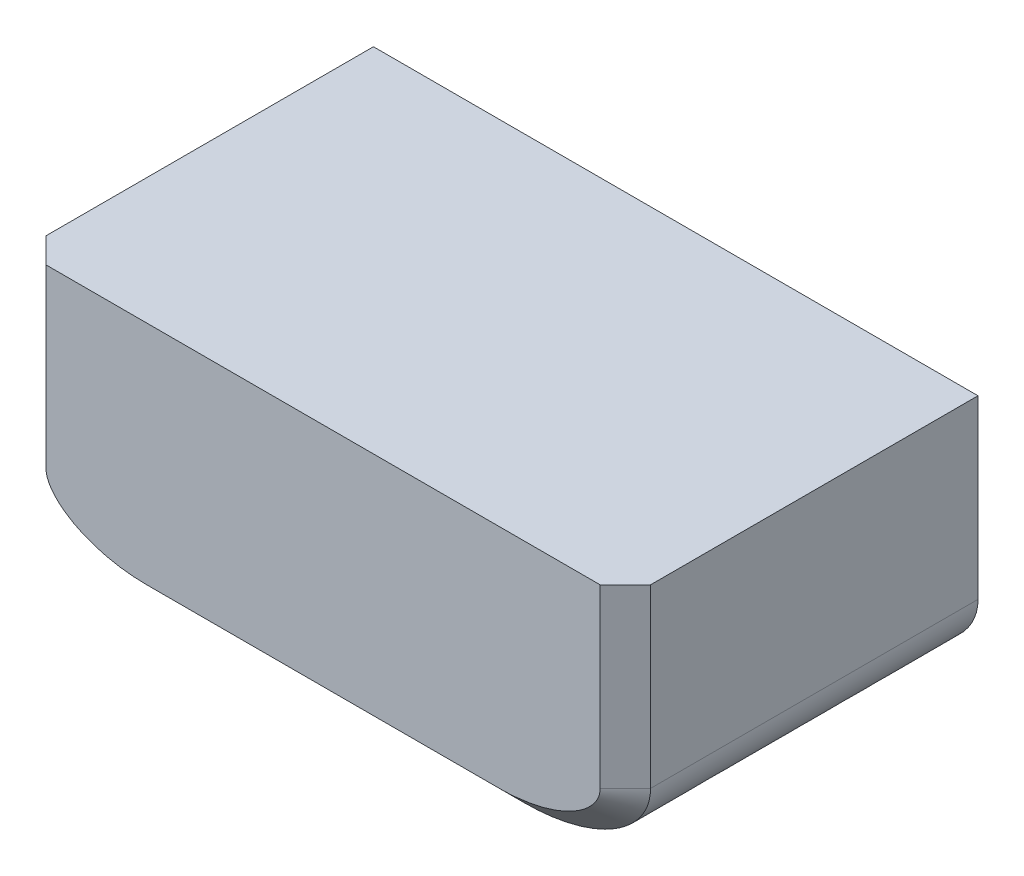
ISO-10303-21;
HEADER;
FILE_DESCRIPTION(('STEP AP214'),'2;1');
FILE_NAME('part.step','',(''),(''),'','','');
FILE_SCHEMA(('AUTOMOTIVE_DESIGN { 1 0 10303 214 1 1 1 1 }'));
ENDSEC;
DATA;
#1=APPLICATION_CONTEXT('core data for automotive mechanical design processes');
#2=APPLICATION_PROTOCOL_DEFINITION('international standard','automotive_design',2000,#1);
#3=PRODUCT_CONTEXT('',#1,'mechanical');
#4=PRODUCT('Part','Part','',(#3));
#5=PRODUCT_RELATED_PRODUCT_CATEGORY('part','',(#4));
#6=PRODUCT_DEFINITION_FORMATION('','',#4);
#7=PRODUCT_DEFINITION_CONTEXT('part definition',#1,'design');
#8=PRODUCT_DEFINITION('design','',#6,#7);
#9=PRODUCT_DEFINITION_SHAPE('','',#8);
#10=(LENGTH_UNIT() NAMED_UNIT(*) SI_UNIT(.MILLI.,.METRE.));
#11=(NAMED_UNIT(*) PLANE_ANGLE_UNIT() SI_UNIT($,.RADIAN.));
#12=(NAMED_UNIT(*) SI_UNIT($,.STERADIAN.) SOLID_ANGLE_UNIT());
#13=UNCERTAINTY_MEASURE_WITH_UNIT(LENGTH_MEASURE(1.E-05),#10,'distance_accuracy_value','');
#14=(GEOMETRIC_REPRESENTATION_CONTEXT(3) GLOBAL_UNCERTAINTY_ASSIGNED_CONTEXT((#13)) GLOBAL_UNIT_ASSIGNED_CONTEXT((#10,
#11,#12)) REPRESENTATION_CONTEXT('',''));
#15=CARTESIAN_POINT('',(0.,0.,0.));
#16=DIRECTION('',(0.,0.,1.));
#17=DIRECTION('',(1.,0.,0.));
#18=AXIS2_PLACEMENT_3D('',#15,#16,#17);
#19=CARTESIAN_POINT('',(-12.,-5.,7.));
#20=DIRECTION('',(1.,0.,0.));
#21=DIRECTION('',(0.,0.,-1.));
#22=AXIS2_PLACEMENT_3D('',#19,#20,#21);
#23=PLANE('',#22);
#24=CARTESIAN_POINT('',(-12.,-2.,7.7));
#25=CARTESIAN_POINT('',(-12.,-2.,2.56666666666667));
#26=CARTESIAN_POINT('',(-12.,-2.,-2.56666666666667));
#27=CARTESIAN_POINT('',(-12.,-2.,-7.7));
#28=(BOUNDED_CURVE() B_SPLINE_CURVE(3,(#24,#25,#26,#27),.UNSPECIFIED.,.F.,
.F.) B_SPLINE_CURVE_WITH_KNOTS((4,4),(-0.0007,0.0147),
.UNSPECIFIED.) CURVE() GEOMETRIC_REPRESENTATION_ITEM() RATIONAL_B_SPLINE_CURVE((1.,1.,1.,1.)) REPRESENTATION_ITEM(''));
#29=CARTESIAN_POINT('',(-12.,-2.,-7.));
#30=VERTEX_POINT('',#29);
#31=CARTESIAN_POINT('',(-12.,-2.,6.));
#32=VERTEX_POINT('',#31);
#33=EDGE_CURVE('E231',#30,#32,#28,.F.);
#34=ORIENTED_EDGE('',*,*,#33,.T.);
#35=DIRECTION('',(0.,1.,0.));
#36=VECTOR('',#35,1.);
#37=CARTESIAN_POINT('',(-12.,5.,6.));
#38=LINE('',#37,#36);
#39=CARTESIAN_POINT('',(-12.,5.,6.));
#40=VERTEX_POINT('',#39);
#41=EDGE_CURVE('E12',#32,#40,#38,.T.);
#42=ORIENTED_EDGE('',*,*,#41,.T.);
#43=DIRECTION('',(0.,0.,-1.));
#44=VECTOR('',#43,1.);
#45=CARTESIAN_POINT('',(-12.,5.,7.));
#46=LINE('',#45,#44);
#47=CARTESIAN_POINT('',(-12.,5.,-7.));
#48=VERTEX_POINT('',#47);
#49=EDGE_CURVE('E147',#40,#48,#46,.T.);
#50=ORIENTED_EDGE('',*,*,#49,.T.);
#51=DIRECTION('',(0.,-1.,0.));
#52=VECTOR('',#51,1.);
#53=CARTESIAN_POINT('',(-12.,-5.,-7.));
#54=LINE('',#53,#52);
#55=EDGE_CURVE('E143',#48,#30,#54,.T.);
#56=ORIENTED_EDGE('',*,*,#55,.T.);
#57=EDGE_LOOP('',(#34,#42,#50,#56));
#58=FACE_BOUND('',#57,.T.);
#59=ADVANCED_FACE('F40',(#58),#23,.F.);
#60=CARTESIAN_POINT('',(12.,-5.,7.));
#61=DIRECTION('',(0.,1.,0.));
#62=DIRECTION('',(-1.,0.,0.));
#63=AXIS2_PLACEMENT_3D('',#60,#61,#62);
#64=PLANE('',#63);
#65=CARTESIAN_POINT('',(7.,-5.,7.7));
#66=CARTESIAN_POINT('',(7.,-5.,2.56666666666667));
#67=CARTESIAN_POINT('',(7.,-5.,-2.56666666666667));
#68=CARTESIAN_POINT('',(7.,-5.,-7.7));
#69=(BOUNDED_CURVE() B_SPLINE_CURVE(3,(#65,#66,#67,#68),.UNSPECIFIED.,.F.,
.F.) B_SPLINE_CURVE_WITH_KNOTS((4,4),(-0.0007,0.0147),
.UNSPECIFIED.) CURVE() GEOMETRIC_REPRESENTATION_ITEM() RATIONAL_B_SPLINE_CURVE((1.,1.,1.,1.)) REPRESENTATION_ITEM(''));
#70=CARTESIAN_POINT('',(7.,-5.,-7.));
#71=VERTEX_POINT('',#70);
#72=CARTESIAN_POINT('',(7.,-5.,6.));
#73=VERTEX_POINT('',#72);
#74=EDGE_CURVE('E522',#71,#73,#69,.F.);
#75=ORIENTED_EDGE('',*,*,#74,.T.);
#76=DIRECTION('',(-1.,0.,0.));
#77=VECTOR('',#76,1.);
#78=CARTESIAN_POINT('',(-7.,-5.,6.));
#79=LINE('',#78,#77);
#80=CARTESIAN_POINT('',(-7.,-5.,6.));
#81=VERTEX_POINT('',#80);
#82=EDGE_CURVE('E68',#73,#81,#79,.T.);
#83=ORIENTED_EDGE('',*,*,#82,.T.);
#84=CARTESIAN_POINT('',(-7.,-5.,-7.7));
#85=CARTESIAN_POINT('',(-7.,-5.,-2.56666666666667));
#86=CARTESIAN_POINT('',(-7.,-5.,2.56666666666667));
#87=CARTESIAN_POINT('',(-7.,-5.,7.7));
#88=(BOUNDED_CURVE() B_SPLINE_CURVE(3,(#84,#85,#86,#87),.UNSPECIFIED.,.F.,
.F.) B_SPLINE_CURVE_WITH_KNOTS((4,4),(-0.000699999999999999,0.0147),
.UNSPECIFIED.) CURVE() GEOMETRIC_REPRESENTATION_ITEM() RATIONAL_B_SPLINE_CURVE((1.,1.,1.,1.)) REPRESENTATION_ITEM(''));
#89=CARTESIAN_POINT('',(-7.,-5.,-7.));
#90=VERTEX_POINT('',#89);
#91=EDGE_CURVE('E311',#81,#90,#88,.F.);
#92=ORIENTED_EDGE('',*,*,#91,.T.);
#93=DIRECTION('',(1.,0.,0.));
#94=VECTOR('',#93,1.);
#95=CARTESIAN_POINT('',(12.,-5.,-7.));
#96=LINE('',#95,#94);
#97=EDGE_CURVE('E157',#90,#71,#96,.T.);
#98=ORIENTED_EDGE('',*,*,#97,.T.);
#99=EDGE_LOOP('',(#75,#83,#92,#98));
#100=FACE_BOUND('',#99,.T.);
#101=ADVANCED_FACE('F207',(#100),#64,.F.);
#102=CARTESIAN_POINT('',(12.,-5.,7.));
#103=DIRECTION('',(-1.,0.,0.));
#104=DIRECTION('',(0.,0.,1.));
#105=AXIS2_PLACEMENT_3D('',#102,#103,#104);
#106=PLANE('',#105);
#107=DIRECTION('',(0.,0.,-1.));
#108=VECTOR('',#107,1.);
#109=CARTESIAN_POINT('',(12.,5.,7.));
#110=LINE('',#109,#108);
#111=CARTESIAN_POINT('',(12.,5.,6.));
#112=VERTEX_POINT('',#111);
#113=CARTESIAN_POINT('',(12.,5.,-7.));
#114=VERTEX_POINT('',#113);
#115=EDGE_CURVE('E645',#112,#114,#110,.T.);
#116=ORIENTED_EDGE('',*,*,#115,.F.);
#117=DIRECTION('',(0.,-1.,0.));
#118=VECTOR('',#117,1.);
#119=CARTESIAN_POINT('',(12.,-2.,6.));
#120=LINE('',#119,#118);
#121=CARTESIAN_POINT('',(12.,-2.,5.99999999999999));
#122=VERTEX_POINT('',#121);
#123=EDGE_CURVE('E506',#112,#122,#120,.T.);
#124=ORIENTED_EDGE('',*,*,#123,.T.);
#125=CARTESIAN_POINT('',(12.,-2.,-7.7));
#126=CARTESIAN_POINT('',(12.,-2.,-2.56666666666667));
#127=CARTESIAN_POINT('',(12.,-2.,2.56666666666667));
#128=CARTESIAN_POINT('',(12.,-2.,7.7));
#129=(BOUNDED_CURVE() B_SPLINE_CURVE(3,(#125,#126,#127,#128),.UNSPECIFIED.,.F.,
.F.) B_SPLINE_CURVE_WITH_KNOTS((4,4),(-0.000699999999999999,0.0147),
.UNSPECIFIED.) CURVE() GEOMETRIC_REPRESENTATION_ITEM() RATIONAL_B_SPLINE_CURVE((1.,1.,1.,1.)) REPRESENTATION_ITEM(''));
#130=CARTESIAN_POINT('',(12.,-2.,-7.));
#131=VERTEX_POINT('',#130);
#132=EDGE_CURVE('E510',#122,#131,#129,.F.);
#133=ORIENTED_EDGE('',*,*,#132,.T.);
#134=DIRECTION('',(0.,1.,0.));
#135=VECTOR('',#134,1.);
#136=CARTESIAN_POINT('',(12.,-5.,-7.));
#137=LINE('',#136,#135);
#138=EDGE_CURVE('E164',#131,#114,#137,.T.);
#139=ORIENTED_EDGE('',*,*,#138,.T.);
#140=EDGE_LOOP('',(#116,#124,#133,#139));
#141=FACE_BOUND('',#140,.T.);
#142=ADVANCED_FACE('F216',(#141),#106,.F.);
#143=CARTESIAN_POINT('',(12.,5.,7.));
#144=DIRECTION('',(0.,-1.,0.));
#145=DIRECTION('',(1.,0.,0.));
#146=AXIS2_PLACEMENT_3D('',#143,#144,#145);
#147=PLANE('',#146);
#148=DIRECTION('',(-1.,0.,0.));
#149=VECTOR('',#148,1.);
#150=CARTESIAN_POINT('',(12.,5.,7.));
#151=LINE('',#150,#149);
#152=CARTESIAN_POINT('',(11.,5.,7.));
#153=VERTEX_POINT('',#152);
#154=CARTESIAN_POINT('',(-11.,5.,7.));
#155=VERTEX_POINT('',#154);
#156=EDGE_CURVE('E144',#153,#155,#151,.T.);
#157=ORIENTED_EDGE('',*,*,#156,.F.);
#158=DIRECTION('',(0.707106781186546,0.,-0.707106781186549));
#159=VECTOR('',#158,1.);
#160=CARTESIAN_POINT('',(11.,5.,7.));
#161=LINE('',#160,#159);
#162=EDGE_CURVE('E504',#153,#112,#161,.T.);
#163=ORIENTED_EDGE('',*,*,#162,.T.);
#164=ORIENTED_EDGE('',*,*,#115,.T.);
#165=DIRECTION('',(-1.,0.,0.));
#166=VECTOR('',#165,1.);
#167=CARTESIAN_POINT('',(12.,5.,-7.));
#168=LINE('',#167,#166);
#169=EDGE_CURVE('E148',#114,#48,#168,.T.);
#170=ORIENTED_EDGE('',*,*,#169,.T.);
#171=ORIENTED_EDGE('',*,*,#49,.F.);
#172=DIRECTION('',(0.707106781186546,0.,0.707106781186549));
#173=VECTOR('',#172,1.);
#174=CARTESIAN_POINT('',(-11.,5.,7.));
#175=LINE('',#174,#173);
#176=EDGE_CURVE('E482',#40,#155,#175,.T.);
#177=ORIENTED_EDGE('',*,*,#176,.T.);
#178=EDGE_LOOP('',(#157,#163,#164,#170,#171,#177));
#179=FACE_BOUND('',#178,.T.);
#180=ADVANCED_FACE('F191',(#179),#147,.F.);
#181=CARTESIAN_POINT('',(0.,0.,7.));
#182=DIRECTION('',(0.,0.,1.));
#183=DIRECTION('',(1.,0.,0.));
#184=AXIS2_PLACEMENT_3D('',#181,#182,#183);
#185=PLANE('',#184);
#186=CARTESIAN_POINT('',(11.,-2.,7.));
#187=CARTESIAN_POINT('',(11.0000009119048,-2.05121489535179,6.99999999999999));
#188=CARTESIAN_POINT('',(10.9950783550603,-2.10140967510281,7.));
#189=CARTESIAN_POINT('',(10.9812447811573,-2.17536549445632,7.));
#190=CARTESIAN_POINT('',(10.9755606525834,-2.19979512754121,6.99999999999999));
#191=CARTESIAN_POINT('',(10.9621929757546,-2.248240124983,7.));
#192=CARTESIAN_POINT('',(10.9545030693753,-2.27227074156179,7.));
#193=CARTESIAN_POINT('',(10.937286363908,-2.31988510228753,7.00000000000001));
#194=CARTESIAN_POINT('',(10.9276885799471,-2.34361899995538,7.));
#195=CARTESIAN_POINT('',(10.9070651599639,-2.390018226245,7.));
#196=CARTESIAN_POINT('',(10.8960166515606,-2.41277637269778,7.));
#197=CARTESIAN_POINT('',(10.8726182979124,-2.45748005976386,7.));
#198=CARTESIAN_POINT('',(10.860267068831,-2.47943069300035,6.99999999999999));
#199=CARTESIAN_POINT('',(10.8343914292635,-2.52261009641036,7.));
#200=CARTESIAN_POINT('',(10.820866292288,-2.54383841951259,7.));
#201=CARTESIAN_POINT('',(10.7786869134161,-2.60653646140608,7.00000000000001));
#202=CARTESIAN_POINT('',(10.7484478847694,-2.64700212753487,7.));
#203=CARTESIAN_POINT('',(10.684239956271,-2.72575416343321,6.99999999999999));
#204=CARTESIAN_POINT('',(10.6506049560552,-2.76362865963416,7.));
#205=CARTESIAN_POINT('',(10.5461676257474,-2.87307261249216,6.99999999999999));
#206=CARTESIAN_POINT('',(10.4715752317629,-2.94089790007462,7.00000000000001));
#207=CARTESIAN_POINT('',(10.3541376821688,-3.0364881135789,7.));
#208=CARTESIAN_POINT('',(10.3139754614098,-3.06736484545583,7.00000000000001));
#209=CARTESIAN_POINT('',(10.2321540710107,-3.12709242008129,6.99999999999999));
#210=CARTESIAN_POINT('',(10.1906625203776,-3.15582502047968,7.));
#211=CARTESIAN_POINT('',(10.0646394223744,-3.23897946206319,7.));
#212=CARTESIAN_POINT('',(9.97840839138811,-3.29050680800064,7.));
#213=CARTESIAN_POINT('',(9.8024620110457,-3.38686761297898,7.00000000000001));
#214=CARTESIAN_POINT('',(9.71269610575805,-3.43171936426778,7.));
#215=CARTESIAN_POINT('',(9.53004085909862,-3.51558840270335,7.));
#216=CARTESIAN_POINT('',(9.43708277652376,-3.55462301043483,7.));
#217=CARTESIAN_POINT('',(9.24855176144679,-3.62729174053516,7.));
#218=CARTESIAN_POINT('',(9.15384301122708,-3.660600807154,7.));
#219=CARTESIAN_POINT('',(8.96340861013527,-3.72195136594616,7.));
#220=CARTESIAN_POINT('',(8.86772364743423,-3.74996999101971,7.));
#221=CARTESIAN_POINT('',(8.57939491197911,-3.82679107459402,7.));
#222=CARTESIAN_POINT('',(8.38547947489632,-3.8683711080258,7.));
#223=CARTESIAN_POINT('',(7.99464869321408,-3.93449324133615,7.));
#224=CARTESIAN_POINT('',(7.79772751918839,-3.95900221774087,7.00000000000001));
#225=CARTESIAN_POINT('',(7.40102209581607,-3.99175936532021,7.));
#226=CARTESIAN_POINT('',(7.20123493129949,-3.99999097234646,7.));
#227=CARTESIAN_POINT('',(7.,-4.,7.));
#228=B_SPLINE_CURVE_WITH_KNOTS('',3,(#186,#187,#188,#189,#190,#191,#192,#193,#194,#195,#196,
#197,#198,#199,#200,#201,#202,#203,#204,#205,#206,#207,#208,#209,#210,#211,#212,#213,#214,#215,
#216,#217,#218,#219,#220,#221,#222,#223,#224,#225,#226,#227),.UNSPECIFIED.,.F.,.F.,(4,2,2,2,2,2,
2,2,2,2,2,2,2,2,2,2,2,2,2,2,4),(0.,0.000148640939524407,0.00022296140928661,
0.000297281879048814,0.000371602348811018,0.000445922818573221,0.000520243288335424,
0.000594563758097628,0.000743204697622036,0.000891845637146442,0.00118912751619526,
0.00133776845571966,0.00148640939524407,0.00178369127429288,0.0020809731533417,
0.00237825503239051,0.00267553691143933,0.00297281879048814,0.00356738254858577,
0.0041619463066834,0.00475651006478103),.UNSPECIFIED.);
#229=CARTESIAN_POINT('',(7.,-4.,7.));
#230=VERTEX_POINT('',#229);
#231=CARTESIAN_POINT('',(11.,-2.,7.));
#232=VERTEX_POINT('',#231);
#233=EDGE_CURVE('E476',#230,#232,#228,.F.);
#234=ORIENTED_EDGE('',*,*,#233,.T.);
#235=DIRECTION('',(0.,1.,0.));
#236=VECTOR('',#235,1.);
#237=CARTESIAN_POINT('',(11.,5.,7.));
#238=LINE('',#237,#236);
#239=EDGE_CURVE('E480',#232,#153,#238,.T.);
#240=ORIENTED_EDGE('',*,*,#239,.T.);
#241=ORIENTED_EDGE('',*,*,#156,.T.);
#242=DIRECTION('',(0.,-1.,0.));
#243=VECTOR('',#242,1.);
#244=CARTESIAN_POINT('',(-11.,-2.,7.));
#245=LINE('',#244,#243);
#246=CARTESIAN_POINT('',(-11.,-2.,7.));
#247=VERTEX_POINT('',#246);
#248=EDGE_CURVE('E485',#155,#247,#245,.T.);
#249=ORIENTED_EDGE('',*,*,#248,.T.);
#250=CARTESIAN_POINT('',(-7.,-4.,7.));
#251=CARTESIAN_POINT('',(-7.20103267157133,-3.9999910101215,7.));
#252=CARTESIAN_POINT('',(-7.40089953347798,-3.99177599214083,7.));
#253=CARTESIAN_POINT('',(-7.79830366117277,-3.95894813124057,7.));
#254=CARTESIAN_POINT('',(-7.99584360226925,-3.93435412828768,7.00000000000002));
#255=CARTESIAN_POINT('',(-8.29030354033918,-3.88444131689906,7.));
#256=CARTESIAN_POINT('',(-8.38814782366345,-3.86562848521691,7.));
#257=CARTESIAN_POINT('',(-8.58318204497513,-3.82339694142413,7.));
#258=CARTESIAN_POINT('',(-8.68041436755107,-3.79996721863904,7.));
#259=CARTESIAN_POINT('',(-8.87400589869206,-3.74819941447669,7.));
#260=CARTESIAN_POINT('',(-8.97076806800785,-3.71972889208624,7.));
#261=CARTESIAN_POINT('',(-9.16191953179073,-3.65783813575903,7.));
#262=CARTESIAN_POINT('',(-9.25633431255359,-3.62443820392169,7.00000000000001));
#263=CARTESIAN_POINT('',(-9.44273092015919,-3.55228881267669,7.));
#264=CARTESIAN_POINT('',(-9.53470238150908,-3.51355005745802,6.99999999999999));
#265=CARTESIAN_POINT('',(-9.71591160659285,-3.43013638575158,7.));
#266=CARTESIAN_POINT('',(-9.80515351716429,-3.38547047479384,6.99999999999999));
#267=CARTESIAN_POINT('',(-9.93665133484236,-3.31333596041005,7.));
#268=CARTESIAN_POINT('',(-9.98008928464857,-3.28843413603348,7.));
#269=CARTESIAN_POINT('',(-10.0660997555025,-3.23675122862319,7.));
#270=CARTESIAN_POINT('',(-10.1086607393613,-3.20997866881161,7.));
#271=CARTESIAN_POINT('',(-10.1928709099999,-3.15431929979647,6.99999999999999));
#272=CARTESIAN_POINT('',(-10.2344669939555,-3.12545605413567,7.00000000000001));
#273=CARTESIAN_POINT('',(-10.3157488425567,-3.06601567901186,7.));
#274=CARTESIAN_POINT('',(-10.3555812080124,-3.03534429299418,7.));
#275=CARTESIAN_POINT('',(-10.4333655650268,-2.97196731402588,7.));
#276=CARTESIAN_POINT('',(-10.4713340929539,-2.93925333542048,7.));
#277=CARTESIAN_POINT('',(-10.545190046215,-2.87151482017851,7.));
#278=CARTESIAN_POINT('',(-10.5810799529522,-2.83649303870525,7.));
#279=CARTESIAN_POINT('',(-10.6504549212715,-2.76377948021736,7.));
#280=CARTESIAN_POINT('',(-10.6839168470333,-2.72612432388271,7.));
#281=CARTESIAN_POINT('',(-10.7320326372638,-2.6671485557458,7.));
#282=CARTESIAN_POINT('',(-10.7476820410724,-2.64711630051731,7.));
#283=CARTESIAN_POINT('',(-10.7779055871287,-2.60654660509794,7.));
#284=CARTESIAN_POINT('',(-10.792528232378,-2.58595095100802,7.));
#285=CARTESIAN_POINT('',(-10.83472794193,-2.52325515366926,7.));
#286=CARTESIAN_POINT('',(-10.8607125139547,-2.48018223126893,7.));
#287=CARTESIAN_POINT('',(-10.8957524403924,-2.4133029986,7.));
#288=CARTESIAN_POINT('',(-10.9067787512479,-2.39062285353945,6.99999999999999));
#289=CARTESIAN_POINT('',(-10.9273508168564,-2.34441758566348,7.));
#290=CARTESIAN_POINT('',(-10.9369146748772,-2.32084549300054,7.));
#291=CARTESIAN_POINT('',(-10.9543040679544,-2.27288631905022,7.));
#292=CARTESIAN_POINT('',(-10.9620340600834,-2.24877054831686,7.00000000000001));
#293=CARTESIAN_POINT('',(-10.9754843042794,-2.20011652388051,6.99999999999999));
#294=CARTESIAN_POINT('',(-10.9811960546379,-2.17559917794878,7.));
#295=CARTESIAN_POINT('',(-10.995083220398,-2.10143707758045,6.99999999999999));
#296=CARTESIAN_POINT('',(-11.0000012931631,-2.05118052187736,7.));
#297=CARTESIAN_POINT('',(-11.,-2.,7.));
#298=B_SPLINE_CURVE_WITH_KNOTS('',3,(#250,#251,#252,#253,#254,#255,#256,#257,#258,#259,#260,
#261,#262,#263,#264,#265,#266,#267,#268,#269,#270,#271,#272,#273,#274,#275,#276,#277,#278,#279,
#280,#281,#282,#283,#284,#285,#286,#287,#288,#289,#290,#291,#292,#293,#294,#295,#296,#297),
.UNSPECIFIED.,.F.,.F.,(4,2,2,2,2,2,2,2,2,2,2,2,2,2,2,2,2,2,2,2,2,2,2,4),(0.,
0.000603608815767041,0.00120721763153408,0.0015090220394176,0.00181082644730112,
0.00211263085518464,0.00241443526306816,0.00271623967095168,0.0030180440788352,
0.00316894628277697,0.00331984848671873,0.00347075069066049,0.00362165289460225,
0.00377255509854401,0.00392345730248577,0.00407435950642753,0.00414981060839841,
0.00422526171036929,0.00437616391431105,0.00445161501628193,0.00452706611825281,
0.00460251722022369,0.00467796832219457,0.00482887052613633),.UNSPECIFIED.);
#299=CARTESIAN_POINT('',(-7.,-4.,7.));
#300=VERTEX_POINT('',#299);
#301=EDGE_CURVE('E475',#247,#300,#298,.F.);
#302=ORIENTED_EDGE('',*,*,#301,.T.);
#303=DIRECTION('',(1.,0.,0.));
#304=VECTOR('',#303,1.);
#305=CARTESIAN_POINT('',(7.,-4.,7.));
#306=LINE('',#305,#304);
#307=EDGE_CURVE('E481',#300,#230,#306,.T.);
#308=ORIENTED_EDGE('',*,*,#307,.T.);
#309=EDGE_LOOP('',(#234,#240,#241,#249,#302,#308));
#310=FACE_BOUND('',#309,.T.);
#311=ADVANCED_FACE('F187',(#310),#185,.T.);
#312=CARTESIAN_POINT('',(0.,0.,-7.));
#313=DIRECTION('',(0.,0.,1.));
#314=DIRECTION('',(1.,0.,0.));
#315=AXIS2_PLACEMENT_3D('',#312,#313,#314);
#316=PLANE('',#315);
#317=CARTESIAN_POINT('',(5.5,0.,-7.));
#318=DIRECTION('',(0.,0.,-1.));
#319=DIRECTION('',(-1.,0.,0.));
#320=AXIS2_PLACEMENT_3D('',#317,#318,#319);
#321=CIRCLE('',#320,1.99999999999999);
#322=CARTESIAN_POINT('',(3.50000000000001,0.,-7.));
#323=VERTEX_POINT('',#322);
#324=EDGE_CURVE('E132',#323,#323,#321,.T.);
#325=ORIENTED_EDGE('',*,*,#324,.F.);
#326=EDGE_LOOP('',(#325));
#327=FACE_BOUND('',#326,.T.);
#328=CARTESIAN_POINT('',(-5.5,0.,-7.));
#329=DIRECTION('',(0.,0.,-1.));
#330=DIRECTION('',(-1.,0.,0.));
#331=AXIS2_PLACEMENT_3D('',#328,#329,#330);
#332=CIRCLE('',#331,1.99999999999999);
#333=CARTESIAN_POINT('',(-7.49999999999999,0.,-7.));
#334=VERTEX_POINT('',#333);
#335=EDGE_CURVE('E131',#334,#334,#332,.T.);
#336=ORIENTED_EDGE('',*,*,#335,.F.);
#337=EDGE_LOOP('',(#336));
#338=FACE_BOUND('',#337,.T.);
#339=ORIENTED_EDGE('',*,*,#138,.F.);
#340=CARTESIAN_POINT('',(7.,-5.,-7.));
#341=CARTESIAN_POINT('',(12.,-5.,-7.));
#342=CARTESIAN_POINT('',(12.,-2.,-7.));
#343=(BOUNDED_CURVE() B_SPLINE_CURVE(2,(#340,#341,#342),.UNSPECIFIED.,.F.,
.F.) B_SPLINE_CURVE_WITH_KNOTS((3,3),(0.,1.),
.UNSPECIFIED.) CURVE() GEOMETRIC_REPRESENTATION_ITEM() RATIONAL_B_SPLINE_CURVE((1.,
0.707106781186548,1.)) REPRESENTATION_ITEM(''));
#344=EDGE_CURVE('E246',#131,#71,#343,.F.);
#345=ORIENTED_EDGE('',*,*,#344,.T.);
#346=ORIENTED_EDGE('',*,*,#97,.F.);
#347=CARTESIAN_POINT('',(-12.,-2.,-7.));
#348=CARTESIAN_POINT('',(-12.,-5.,-7.));
#349=CARTESIAN_POINT('',(-7.,-5.,-7.));
#350=(BOUNDED_CURVE() B_SPLINE_CURVE(2,(#347,#348,#349),.UNSPECIFIED.,.F.,
.F.) B_SPLINE_CURVE_WITH_KNOTS((3,3),(0.,1.),
.UNSPECIFIED.) CURVE() GEOMETRIC_REPRESENTATION_ITEM() RATIONAL_B_SPLINE_CURVE((1.,
0.707106781186547,1.)) REPRESENTATION_ITEM(''));
#351=EDGE_CURVE('E170',#90,#30,#350,.F.);
#352=ORIENTED_EDGE('',*,*,#351,.T.);
#353=ORIENTED_EDGE('',*,*,#55,.F.);
#354=ORIENTED_EDGE('',*,*,#169,.F.);
#355=EDGE_LOOP('',(#339,#345,#346,#352,#353,#354));
#356=FACE_BOUND('',#355,.T.);
#357=ADVANCED_FACE('F176',(#327,#338,#356),#316,.F.);
#358=CARTESIAN_POINT('',(-5.5,0.,-2.));
#359=DIRECTION('',(0.,0.,-1.));
#360=DIRECTION('',(-1.,0.,0.));
#361=AXIS2_PLACEMENT_3D('',#358,#359,#360);
#362=CONICAL_SURFACE('',#361,1.99999999999999,1.02974425867665);
#363=CARTESIAN_POINT('',(-5.5,0.,-0.798278761944879));
#364=VERTEX_POINT('',#363);
#365=VERTEX_LOOP('',#364);
#366=FACE_BOUND('',#365,.T.);
#367=CARTESIAN_POINT('',(-5.5,0.,-2.));
#368=DIRECTION('',(0.,0.,-1.));
#369=DIRECTION('',(-1.,0.,0.));
#370=AXIS2_PLACEMENT_3D('',#367,#368,#369);
#371=CIRCLE('',#370,1.99999999999999);
#372=CARTESIAN_POINT('',(-7.49999999999999,0.,-2.));
#373=VERTEX_POINT('',#372);
#374=EDGE_CURVE('E135',#373,#373,#371,.T.);
#375=ORIENTED_EDGE('',*,*,#374,.T.);
#376=EDGE_LOOP('',(#375));
#377=FACE_BOUND('',#376,.T.);
#378=ADVANCED_FACE('F186',(#366,#377),#362,.F.);
#379=CARTESIAN_POINT('',(-5.5,0.,-7.));
#380=DIRECTION('',(0.,0.,-1.));
#381=DIRECTION('',(-1.,0.,0.));
#382=AXIS2_PLACEMENT_3D('',#379,#380,#381);
#383=CYLINDRICAL_SURFACE('',#382,1.99999999999999);
#384=ORIENTED_EDGE('',*,*,#374,.F.);
#385=EDGE_LOOP('',(#384));
#386=FACE_BOUND('',#385,.T.);
#387=ORIENTED_EDGE('',*,*,#335,.T.);
#388=EDGE_LOOP('',(#387));
#389=FACE_BOUND('',#388,.T.);
#390=ADVANCED_FACE('F125',(#386,#389),#383,.F.);
#391=CARTESIAN_POINT('',(5.5,0.,-2.));
#392=DIRECTION('',(0.,0.,-1.));
#393=DIRECTION('',(-1.,0.,0.));
#394=AXIS2_PLACEMENT_3D('',#391,#392,#393);
#395=CONICAL_SURFACE('',#394,1.99999999999999,1.02974425867665);
#396=CARTESIAN_POINT('',(5.5,0.,-0.798278761944879));
#397=VERTEX_POINT('',#396);
#398=VERTEX_LOOP('',#397);
#399=FACE_BOUND('',#398,.T.);
#400=CARTESIAN_POINT('',(5.5,0.,-2.));
#401=DIRECTION('',(0.,0.,-1.));
#402=DIRECTION('',(-1.,0.,0.));
#403=AXIS2_PLACEMENT_3D('',#400,#401,#402);
#404=CIRCLE('',#403,1.99999999999999);
#405=CARTESIAN_POINT('',(3.50000000000001,0.,-2.));
#406=VERTEX_POINT('',#405);
#407=EDGE_CURVE('E129',#406,#406,#404,.T.);
#408=ORIENTED_EDGE('',*,*,#407,.T.);
#409=EDGE_LOOP('',(#408));
#410=FACE_BOUND('',#409,.T.);
#411=ADVANCED_FACE('F121',(#399,#410),#395,.F.);
#412=CARTESIAN_POINT('',(5.5,0.,-7.));
#413=DIRECTION('',(0.,0.,-1.));
#414=DIRECTION('',(-1.,0.,0.));
#415=AXIS2_PLACEMENT_3D('',#412,#413,#414);
#416=CYLINDRICAL_SURFACE('',#415,1.99999999999999);
#417=ORIENTED_EDGE('',*,*,#407,.F.);
#418=EDGE_LOOP('',(#417));
#419=FACE_BOUND('',#418,.T.);
#420=ORIENTED_EDGE('',*,*,#324,.T.);
#421=EDGE_LOOP('',(#420));
#422=FACE_BOUND('',#421,.T.);
#423=ADVANCED_FACE('F124',(#419,#422),#416,.F.);
#424=CARTESIAN_POINT('',(12.,-2.,7.7));
#425=CARTESIAN_POINT('',(12.,-2.,2.56666666666667));
#426=CARTESIAN_POINT('',(12.,-2.,-2.56666666666667));
#427=CARTESIAN_POINT('',(12.,-2.,-7.7));
#428=CARTESIAN_POINT('',(12.,-5.,7.7));
#429=CARTESIAN_POINT('',(12.,-5.,2.56666666666667));
#430=CARTESIAN_POINT('',(12.,-5.,-2.56666666666667));
#431=CARTESIAN_POINT('',(12.,-5.,-7.7));
#432=CARTESIAN_POINT('',(7.,-5.,7.7));
#433=CARTESIAN_POINT('',(7.,-5.,2.56666666666667));
#434=CARTESIAN_POINT('',(7.,-5.,-2.56666666666667));
#435=CARTESIAN_POINT('',(7.,-5.,-7.7));
#436=(BOUNDED_SURFACE() B_SPLINE_SURFACE(2,3,((#424,#425,#426,#427),(#428,#429,#430,#431),(#432,
#433,#434,#435)),.UNSPECIFIED.,.F.,.F.,.F.) B_SPLINE_SURFACE_WITH_KNOTS((3,3),(4,4),(0.,1.),
(-0.0007,0.0147),.UNSPECIFIED.) GEOMETRIC_REPRESENTATION_ITEM() RATIONAL_B_SPLINE_SURFACE(((1.,
1.,1.,1.),(0.707106781186548,0.707106781186548,0.707106781186548,0.707106781186548),(1.,1.,1.,1.))) REPRESENTATION_ITEM('') SURFACE());
#437=CARTESIAN_POINT('',(12.,-2.,5.99999999999999));
#438=CARTESIAN_POINT('',(12.,-5.,6.));
#439=CARTESIAN_POINT('',(7.,-5.,5.99999999999999));
#440=(BOUNDED_CURVE() B_SPLINE_CURVE(2,(#437,#438,#439),.UNSPECIFIED.,.F.,
.F.) B_SPLINE_CURVE_WITH_KNOTS((3,3),(0.,1.),
.UNSPECIFIED.) CURVE() GEOMETRIC_REPRESENTATION_ITEM() RATIONAL_B_SPLINE_CURVE((1.,
0.707106781186548,1.)) REPRESENTATION_ITEM(''));
#441=EDGE_CURVE('E313',#122,#73,#440,.T.);
#442=ORIENTED_EDGE('',*,*,#132,.F.);
#443=ORIENTED_EDGE('',*,*,#441,.T.);
#444=ORIENTED_EDGE('',*,*,#74,.F.);
#445=ORIENTED_EDGE('',*,*,#344,.F.);
#446=EDGE_LOOP('',(#442,#443,#444,#445));
#447=FACE_BOUND('',#446,.T.);
#448=ADVANCED_FACE('F255',(#447),#436,.T.);
#449=CARTESIAN_POINT('',(-7.,-5.,7.7));
#450=CARTESIAN_POINT('',(-7.,-5.,2.56666666666667));
#451=CARTESIAN_POINT('',(-7.,-5.,-2.56666666666667));
#452=CARTESIAN_POINT('',(-7.,-5.,-7.7));
#453=CARTESIAN_POINT('',(-12.,-5.,7.7));
#454=CARTESIAN_POINT('',(-12.,-5.,2.56666666666667));
#455=CARTESIAN_POINT('',(-12.,-5.,-2.56666666666667));
#456=CARTESIAN_POINT('',(-12.,-5.,-7.7));
#457=CARTESIAN_POINT('',(-12.,-2.,7.7));
#458=CARTESIAN_POINT('',(-12.,-2.,2.56666666666667));
#459=CARTESIAN_POINT('',(-12.,-2.,-2.56666666666667));
#460=CARTESIAN_POINT('',(-12.,-2.,-7.7));
#461=(BOUNDED_SURFACE() B_SPLINE_SURFACE(2,3,((#449,#450,#451,#452),(#453,#454,#455,#456),(#457,
#458,#459,#460)),.UNSPECIFIED.,.F.,.F.,.F.) B_SPLINE_SURFACE_WITH_KNOTS((3,3),(4,4),(0.,1.),
(-0.0007,0.0147),.UNSPECIFIED.) GEOMETRIC_REPRESENTATION_ITEM() RATIONAL_B_SPLINE_SURFACE(((1.,
1.,1.,1.),(0.707106781186547,0.707106781186547,0.707106781186547,0.707106781186547),(1.,1.,1.,1.))) REPRESENTATION_ITEM('') SURFACE());
#462=CARTESIAN_POINT('',(-7.,-5.,5.99999999999999));
#463=CARTESIAN_POINT('',(-12.,-5.,5.99999999999999));
#464=CARTESIAN_POINT('',(-12.,-2.,5.99999999999999));
#465=(BOUNDED_CURVE() B_SPLINE_CURVE(2,(#462,#463,#464),.UNSPECIFIED.,.F.,
.F.) B_SPLINE_CURVE_WITH_KNOTS((3,3),(0.,1.),
.UNSPECIFIED.) CURVE() GEOMETRIC_REPRESENTATION_ITEM() RATIONAL_B_SPLINE_CURVE((1.,
0.707106781186547,1.)) REPRESENTATION_ITEM(''));
#466=EDGE_CURVE('E52',#81,#32,#465,.T.);
#467=ORIENTED_EDGE('',*,*,#91,.F.);
#468=ORIENTED_EDGE('',*,*,#466,.T.);
#469=ORIENTED_EDGE('',*,*,#33,.F.);
#470=ORIENTED_EDGE('',*,*,#351,.F.);
#471=EDGE_LOOP('',(#467,#468,#469,#470));
#472=FACE_BOUND('',#471,.T.);
#473=ADVANCED_FACE('F268',(#472),#461,.T.);
#474=CARTESIAN_POINT('',(-11.,0.,7.));
#475=DIRECTION('',(-0.707106781186549,0.,0.707106781186546));
#476=DIRECTION('',(0.,1.,0.));
#477=AXIS2_PLACEMENT_3D('',#474,#475,#476);
#478=PLANE('',#477);
#479=ORIENTED_EDGE('',*,*,#176,.F.);
#480=ORIENTED_EDGE('',*,*,#41,.F.);
#481=CARTESIAN_POINT('',(-11.,-2.,7.));
#482=CARTESIAN_POINT('',(-12.,-2.,6.));
#483=B_SPLINE_CURVE_WITH_KNOTS('',1,(#481,#482),.UNSPECIFIED.,.F.,.F.,(2,2),(0.,1.),.UNSPECIFIED.);
#484=EDGE_CURVE('E138',#247,#32,#483,.T.);
#485=ORIENTED_EDGE('',*,*,#484,.F.);
#486=ORIENTED_EDGE('',*,*,#248,.F.);
#487=EDGE_LOOP('',(#479,#480,#485,#486));
#488=FACE_BOUND('',#487,.T.);
#489=ADVANCED_FACE('F43',(#488),#478,.T.);
#490=CARTESIAN_POINT('',(-11.,-2.,7.));
#491=CARTESIAN_POINT('',(-11.0000012931631,-2.05118052187736,7.));
#492=CARTESIAN_POINT('',(-10.995083220398,-2.10143707758045,6.99999999999999));
#493=CARTESIAN_POINT('',(-10.9811960546379,-2.17559917794878,7.));
#494=CARTESIAN_POINT('',(-10.9754843042794,-2.20011652388051,6.99999999999999));
#495=CARTESIAN_POINT('',(-10.9620340600834,-2.24877054831686,7.00000000000001));
#496=CARTESIAN_POINT('',(-10.9543040679544,-2.27288631905022,7.));
#497=CARTESIAN_POINT('',(-10.9369146748772,-2.32084549300054,7.));
#498=CARTESIAN_POINT('',(-10.9273508168564,-2.34441758566348,7.));
#499=CARTESIAN_POINT('',(-10.9067787512479,-2.39062285353945,6.99999999999999));
#500=CARTESIAN_POINT('',(-10.8957524403924,-2.4133029986,7.));
#501=CARTESIAN_POINT('',(-10.8607125139547,-2.48018223126893,7.));
#502=CARTESIAN_POINT('',(-10.83472794193,-2.52325515366926,7.));
#503=CARTESIAN_POINT('',(-10.792528232378,-2.58595095100802,7.));
#504=CARTESIAN_POINT('',(-10.7779055871287,-2.60654660509794,7.));
#505=CARTESIAN_POINT('',(-10.7476820410724,-2.64711630051731,7.));
#506=CARTESIAN_POINT('',(-10.7320326372638,-2.6671485557458,7.));
#507=CARTESIAN_POINT('',(-10.6839168470333,-2.72612432388271,7.));
#508=CARTESIAN_POINT('',(-10.6504549212715,-2.76377948021736,7.));
#509=CARTESIAN_POINT('',(-10.5810799529522,-2.83649303870525,7.));
#510=CARTESIAN_POINT('',(-10.545190046215,-2.87151482017851,7.));
#511=CARTESIAN_POINT('',(-10.4713340929539,-2.93925333542048,7.));
#512=CARTESIAN_POINT('',(-10.4333655650268,-2.97196731402588,7.));
#513=CARTESIAN_POINT('',(-10.3555812080124,-3.03534429299418,7.));
#514=CARTESIAN_POINT('',(-10.3157488425567,-3.06601567901186,7.));
#515=CARTESIAN_POINT('',(-10.2344669939555,-3.12545605413567,7.00000000000001));
#516=CARTESIAN_POINT('',(-10.1928709099999,-3.15431929979647,6.99999999999999));
#517=CARTESIAN_POINT('',(-10.1086607393613,-3.20997866881161,7.));
#518=CARTESIAN_POINT('',(-10.0660997555025,-3.23675122862319,7.));
#519=CARTESIAN_POINT('',(-9.98008928464857,-3.28843413603348,7.));
#520=CARTESIAN_POINT('',(-9.93665133484236,-3.31333596041005,7.));
#521=CARTESIAN_POINT('',(-9.80515351716429,-3.38547047479384,6.99999999999999));
#522=CARTESIAN_POINT('',(-9.71591160659285,-3.43013638575158,7.));
#523=CARTESIAN_POINT('',(-9.53470238150908,-3.51355005745802,6.99999999999999));
#524=CARTESIAN_POINT('',(-9.44273092015919,-3.55228881267669,7.));
#525=CARTESIAN_POINT('',(-9.25633431255359,-3.62443820392169,7.00000000000001));
#526=CARTESIAN_POINT('',(-9.16191953179073,-3.65783813575903,7.));
#527=CARTESIAN_POINT('',(-8.97076806800785,-3.71972889208624,7.));
#528=CARTESIAN_POINT('',(-8.87400589869206,-3.74819941447669,7.));
#529=CARTESIAN_POINT('',(-8.68041436755107,-3.79996721863904,7.));
#530=CARTESIAN_POINT('',(-8.58318204497513,-3.82339694142413,7.));
#531=CARTESIAN_POINT('',(-8.38814782366345,-3.86562848521691,7.));
#532=CARTESIAN_POINT('',(-8.29030354033918,-3.88444131689906,7.));
#533=CARTESIAN_POINT('',(-7.99584360226925,-3.93435412828768,7.00000000000002));
#534=CARTESIAN_POINT('',(-7.79830366117277,-3.95894813124057,7.));
#535=CARTESIAN_POINT('',(-7.40089953347798,-3.99177599214083,7.));
#536=CARTESIAN_POINT('',(-7.20103267157133,-3.9999910101215,7.));
#537=CARTESIAN_POINT('',(-7.,-4.,7.));
#538=CARTESIAN_POINT('',(-12.,-2.,6.));
#539=CARTESIAN_POINT('',(-12.0000387489371,-2.115209738843,5.99999999999999));
#540=CARTESIAN_POINT('',(-11.9887781915623,-2.22799471089112,5.99999999999999));
#541=CARTESIAN_POINT('',(-11.958727846158,-2.38837424598176,6.));
#542=CARTESIAN_POINT('',(-11.9465638700408,-2.440411748995,5.99999999999999));
#543=CARTESIAN_POINT('',(-11.9186510780156,-2.54137858010403,6.));
#544=CARTESIAN_POINT('',(-11.9029288676386,-2.59027524644182,6.));
#545=CARTESIAN_POINT('',(-11.8685108515412,-2.68519631074647,5.99999999999999));
#546=CARTESIAN_POINT('',(-11.8500084178241,-2.73068810968979,6.));
#547=CARTESIAN_POINT('',(-11.8112154418618,-2.81781803233656,5.99999999999999));
#548=CARTESIAN_POINT('',(-11.7908853885769,-2.85955452807137,6.));
#549=CARTESIAN_POINT('',(-11.7277860251344,-2.97999640381081,5.99999999999999));
#550=CARTESIAN_POINT('',(-11.6828856203539,-3.05404058054868,6.));
#551=CARTESIAN_POINT('',(-11.6128046158091,-3.15816201017267,5.99999999999999));
#552=CARTESIAN_POINT('',(-11.5889501548864,-3.19172989549863,5.99999999999999));
#553=CARTESIAN_POINT('',(-11.540474078108,-3.25680042750027,5.99999999999999));
#554=CARTESIAN_POINT('',(-11.5157758387276,-3.28839263240845,5.99999999999999));
#555=CARTESIAN_POINT('',(-11.4409822893886,-3.38006932745794,5.99999999999999));
#556=CARTESIAN_POINT('',(-11.3904368245642,-3.43682751109117,6.));
#557=CARTESIAN_POINT('',(-11.2881286827274,-3.54406166243289,6.));
#558=CARTESIAN_POINT('',(-11.2363983667829,-3.59446720892884,6.));
#559=CARTESIAN_POINT('',(-11.1319715544434,-3.69024564764562,5.99999999999999));
#560=CARTESIAN_POINT('',(-11.0792708807405,-3.73560576231337,5.99999999999999));
#561=CARTESIAN_POINT('',(-10.9729832228242,-3.82220724381619,6.));
#562=CARTESIAN_POINT('',(-10.9193747929719,-3.86345437787619,6.));
#563=CARTESIAN_POINT('',(-10.8113870980339,-3.94242468095448,6.));
#564=CARTESIAN_POINT('',(-10.7568182903994,-3.98026693542024,5.99999999999999));
#565=CARTESIAN_POINT('',(-10.6475330916872,-4.05249998318707,6.));
#566=CARTESIAN_POINT('',(-10.5928803361387,-4.08686247941127,6.));
#567=CARTESIAN_POINT('',(-10.4834207267164,-4.1526359315356,5.99999999999999));
#568=CARTESIAN_POINT('',(-10.428629296879,-4.1840337811459,6.));
#569=CARTESIAN_POINT('',(-10.2640149541199,-4.27433680938339,5.99999999999999));
#570=CARTESIAN_POINT('',(-10.1539507061428,-4.32935835088559,5.99999999999999));
#571=CARTESIAN_POINT('',(-9.93293780030885,-4.43109580723941,5.99999999999999));
#572=CARTESIAN_POINT('',(-9.82199042680032,-4.47778648351702,5.99999999999999));
#573=CARTESIAN_POINT('',(-9.59902077430466,-4.56409307877897,6.));
#574=CARTESIAN_POINT('',(-9.4870146812766,-4.60368931631918,6.));
#575=CARTESIAN_POINT('',(-9.26170384531724,-4.67664041276653,5.99999999999999));
#576=CARTESIAN_POINT('',(-9.14837672049182,-4.70996661520203,6.));
#577=CARTESIAN_POINT('',(-8.92275168037071,-4.77030061146936,5.99999999999999));
#578=CARTESIAN_POINT('',(-8.80997945524869,-4.79746246062807,5.99999999999999));
#579=CARTESIAN_POINT('',(-8.58460694798876,-4.84626343051369,5.99999999999999));
#580=CARTESIAN_POINT('',(-8.47195866368035,-4.86791347151218,5.99999999999999));
#581=CARTESIAN_POINT('',(-8.13386724911466,-4.92522393208482,6.00000000000001));
#582=CARTESIAN_POINT('',(-7.90828233482844,-4.95326885882369,6.));
#583=CARTESIAN_POINT('',(-7.45556554773415,-4.99066677534687,6.));
#584=CARTESIAN_POINT('',(-7.22844648348107,-4.99998727852814,5.99999999999999));
#585=CARTESIAN_POINT('',(-7.,-5.,6.));
#586=B_SPLINE_SURFACE_WITH_KNOTS('',1,3,((#490,#491,#492,#493,#494,#495,#496,#497,#498,#499,
#500,#501,#502,#503,#504,#505,#506,#507,#508,#509,#510,#511,#512,#513,#514,#515,#516,#517,#518,
#519,#520,#521,#522,#523,#524,#525,#526,#527,#528,#529,#530,#531,#532,#533,#534,#535,#536,#537),
(#538,#539,#540,#541,#542,#543,#544,#545,#546,#547,#548,#549,#550,#551,#552,#553,#554,#555,#556,
#557,#558,#559,#560,#561,#562,#563,#564,#565,#566,#567,#568,#569,#570,#571,#572,#573,#574,#575,
#576,#577,#578,#579,#580,#581,#582,#583,#584,#585)),.UNSPECIFIED.,.F.,.F.,.F.,(2,2),(4,2,2,2,2,
2,2,2,2,2,2,2,2,2,2,2,2,2,2,2,2,2,2,4),(0.,1.),(0.,0.00015090220394176,0.00022635330591264,
0.00030180440788352,0.000377255509854401,0.000452706611825281,0.000603608815767041,
0.000679059917737921,0.000754511019708801,0.000905413223650561,0.00105631542759232,
0.00120721763153408,0.00135811983547584,0.0015090220394176,0.00165992424335936,
0.00181082644730112,0.00211263085518464,0.00241443526306816,0.00271623967095168,
0.0030180440788352,0.00331984848671873,0.00362165289460225,0.00422526171036929,
0.00482887052613633),.UNSPECIFIED.);
#587=CARTESIAN_POINT('',(-7.,-5.,6.));
#588=CARTESIAN_POINT('',(-7.,-4.,7.));
#589=B_SPLINE_CURVE_WITH_KNOTS('',1,(#587,#588),.UNSPECIFIED.,.F.,.F.,(2,2),(0.,1.),.UNSPECIFIED.);
#590=EDGE_CURVE('E414',#300,#81,#589,.F.);
#591=ORIENTED_EDGE('',*,*,#484,.T.);
#592=ORIENTED_EDGE('',*,*,#466,.F.);
#593=ORIENTED_EDGE('',*,*,#590,.F.);
#594=ORIENTED_EDGE('',*,*,#301,.F.);
#595=EDGE_LOOP('',(#591,#592,#593,#594));
#596=FACE_BOUND('',#595,.T.);
#597=ADVANCED_FACE('F431',(#596),#586,.T.);
#598=CARTESIAN_POINT('',(0.,-4.,7.));
#599=DIRECTION('',(0.,-0.707106781186549,0.707106781186546));
#600=DIRECTION('',(-1.,0.,0.));
#601=AXIS2_PLACEMENT_3D('',#598,#599,#600);
#602=PLANE('',#601);
#603=ORIENTED_EDGE('',*,*,#590,.T.);
#604=ORIENTED_EDGE('',*,*,#82,.F.);
#605=CARTESIAN_POINT('',(7.,-4.,7.));
#606=CARTESIAN_POINT('',(7.,-5.,6.));
#607=B_SPLINE_CURVE_WITH_KNOTS('',1,(#605,#606),.UNSPECIFIED.,.F.,.F.,(2,2),(0.,1.),.UNSPECIFIED.);
#608=EDGE_CURVE('E392',#230,#73,#607,.T.);
#609=ORIENTED_EDGE('',*,*,#608,.F.);
#610=ORIENTED_EDGE('',*,*,#307,.F.);
#611=EDGE_LOOP('',(#603,#604,#609,#610));
#612=FACE_BOUND('',#611,.T.);
#613=ADVANCED_FACE('F359',(#612),#602,.T.);
#614=CARTESIAN_POINT('',(7.,-4.,7.));
#615=CARTESIAN_POINT('',(7.20123493129949,-3.99999097234646,7.));
#616=CARTESIAN_POINT('',(7.40102209581607,-3.99175936532021,7.));
#617=CARTESIAN_POINT('',(7.79772751918839,-3.95900221774087,7.00000000000001));
#618=CARTESIAN_POINT('',(7.99464869321408,-3.93449324133615,7.));
#619=CARTESIAN_POINT('',(8.38547947489632,-3.8683711080258,7.));
#620=CARTESIAN_POINT('',(8.57939491197911,-3.82679107459402,7.));
#621=CARTESIAN_POINT('',(8.86772364743423,-3.74996999101971,7.));
#622=CARTESIAN_POINT('',(8.96340861013527,-3.72195136594616,7.));
#623=CARTESIAN_POINT('',(9.15384301122708,-3.660600807154,7.));
#624=CARTESIAN_POINT('',(9.24855176144679,-3.62729174053516,7.));
#625=CARTESIAN_POINT('',(9.43708277652376,-3.55462301043483,7.));
#626=CARTESIAN_POINT('',(9.53004085909862,-3.51558840270335,7.));
#627=CARTESIAN_POINT('',(9.71269610575805,-3.43171936426778,7.));
#628=CARTESIAN_POINT('',(9.8024620110457,-3.38686761297898,7.00000000000001));
#629=CARTESIAN_POINT('',(9.97840839138811,-3.29050680800064,7.));
#630=CARTESIAN_POINT('',(10.0646394223744,-3.23897946206319,7.));
#631=CARTESIAN_POINT('',(10.1906625203776,-3.15582502047968,7.));
#632=CARTESIAN_POINT('',(10.2321540710107,-3.12709242008129,6.99999999999999));
#633=CARTESIAN_POINT('',(10.3139754614098,-3.06736484545583,7.00000000000001));
#634=CARTESIAN_POINT('',(10.3541376821688,-3.0364881135789,7.));
#635=CARTESIAN_POINT('',(10.4715752317629,-2.94089790007462,7.00000000000001));
#636=CARTESIAN_POINT('',(10.5461676257474,-2.87307261249216,6.99999999999999));
#637=CARTESIAN_POINT('',(10.6506049560552,-2.76362865963416,7.));
#638=CARTESIAN_POINT('',(10.684239956271,-2.72575416343321,6.99999999999999));
#639=CARTESIAN_POINT('',(10.7484478847694,-2.64700212753487,7.));
#640=CARTESIAN_POINT('',(10.7786869134161,-2.60653646140608,7.00000000000001));
#641=CARTESIAN_POINT('',(10.820866292288,-2.54383841951259,7.));
#642=CARTESIAN_POINT('',(10.8343914292635,-2.52261009641036,7.));
#643=CARTESIAN_POINT('',(10.860267068831,-2.47943069300035,6.99999999999999));
#644=CARTESIAN_POINT('',(10.8726182979124,-2.45748005976386,7.));
#645=CARTESIAN_POINT('',(10.8960166515606,-2.41277637269778,7.));
#646=CARTESIAN_POINT('',(10.9070651599639,-2.390018226245,7.));
#647=CARTESIAN_POINT('',(10.9276885799471,-2.34361899995538,7.));
#648=CARTESIAN_POINT('',(10.937286363908,-2.31988510228753,7.00000000000001));
#649=CARTESIAN_POINT('',(10.9545030693753,-2.27227074156179,7.));
#650=CARTESIAN_POINT('',(10.9621929757546,-2.248240124983,7.));
#651=CARTESIAN_POINT('',(10.9755606525834,-2.19979512754121,6.99999999999999));
#652=CARTESIAN_POINT('',(10.9812447811573,-2.17536549445632,7.));
#653=CARTESIAN_POINT('',(10.9950783550603,-2.10140967510281,7.));
#654=CARTESIAN_POINT('',(11.0000009119048,-2.05121489535179,6.99999999999999));
#655=CARTESIAN_POINT('',(11.,-2.,7.));
#656=CARTESIAN_POINT('',(7.,-5.,6.));
#657=CARTESIAN_POINT('',(7.22867615821614,-4.99998725457635,5.99999999999999));
#658=CARTESIAN_POINT('',(7.45570563445527,-4.9906477568522,5.99999999999999));
#659=CARTESIAN_POINT('',(7.90762554000383,-4.95333055057366,6.));
#660=CARTESIAN_POINT('',(8.13250379880133,-4.92538239816848,5.99999999999999));
#661=CARTESIAN_POINT('',(8.58122886369878,-4.84946269179998,5.99999999999999));
#662=CARTESIAN_POINT('',(8.80505490750223,-4.80155605198289,5.99999999999999));
#663=CARTESIAN_POINT('',(9.1410366606219,-4.71203345685241,5.99999999999999));
#664=CARTESIAN_POINT('',(9.25306990533563,-4.67924704912226,6.));
#665=CARTESIAN_POINT('',(9.47745741772781,-4.60695764313759,5.99999999999999));
#666=CARTESIAN_POINT('',(9.58975852701243,-4.56748817965854,6.));
#667=CARTESIAN_POINT('',(9.81519000263614,-4.48059574407587,6.));
#668=CARTESIAN_POINT('',(9.92728904276422,-4.43356500215347,6.));
#669=CARTESIAN_POINT('',(10.1499937925264,-4.33130519569636,6.));
#670=CARTESIAN_POINT('',(10.2606762523051,-4.27606927561159,6.));
#671=CARTESIAN_POINT('',(10.4808727082802,-4.15547067572942,6.));
#672=CARTESIAN_POINT('',(10.590444744766,-4.09011195972083,6.));
#673=CARTESIAN_POINT('',(10.7539324824542,-3.98223273166567,5.99999999999999));
#674=CARTESIAN_POINT('',(10.8083388073806,-3.94458075017083,5.99999999999999));
#675=CARTESIAN_POINT('',(10.9169954035098,-3.86526387642707,6.));
#676=CARTESIAN_POINT('',(10.9710264551247,-3.8237600254533,6.));
#677=CARTESIAN_POINT('',(11.1314514187235,-3.69317068705781,6.));
#678=CARTESIAN_POINT('',(11.2366597995162,-3.59801210562121,5.99999999999999));
#679=CARTESIAN_POINT('',(11.3906496999849,-3.43660268872862,5.99999999999999));
#680=CARTESIAN_POINT('',(11.4414734956546,-3.37950769174015,5.99999999999999));
#681=CARTESIAN_POINT('',(11.541303704689,-3.25706147231288,6.));
#682=CARTESIAN_POINT('',(11.5898108045198,-3.19236183226075,6.));
#683=CARTESIAN_POINT('',(11.6598694259921,-3.08821765659302,5.99999999999999));
#684=CARTESIAN_POINT('',(11.6827655808824,-3.05232305306275,6.));
#685=CARTESIAN_POINT('',(11.7274380244113,-2.97777657958844,5.99999999999999));
#686=CARTESIAN_POINT('',(11.7492176994261,-2.93912578963387,6.));
#687=CARTESIAN_POINT('',(11.7913694671652,-2.85859241575932,5.99999999999999));
#688=CARTESIAN_POINT('',(11.8117468277239,-2.81669696490844,6.));
#689=CARTESIAN_POINT('',(11.8506543394279,-2.7291624486891,6.));
#690=CARTESIAN_POINT('',(11.8692368762878,-2.68332222219182,6.));
#691=CARTESIAN_POINT('',(11.9033326723343,-2.58902929772855,5.99999999999999));
#692=CARTESIAN_POINT('',(11.918977245916,-2.54029097234576,5.99999999999999));
#693=CARTESIAN_POINT('',(11.9467259918733,-2.43973140729369,5.99999999999999));
#694=CARTESIAN_POINT('',(11.9588324621441,-2.38787291173018,5.99999999999999));
#695=CARTESIAN_POINT('',(11.9887691963276,-2.22792735581036,6.));
#696=CARTESIAN_POINT('',(12.00003741755,-2.1152883656893,5.99999999999999));
#697=CARTESIAN_POINT('',(12.,-2.,6.));
#698=B_SPLINE_SURFACE_WITH_KNOTS('',1,3,((#614,#615,#616,#617,#618,#619,#620,#621,#622,#623,
#624,#625,#626,#627,#628,#629,#630,#631,#632,#633,#634,#635,#636,#637,#638,#639,#640,#641,#642,
#643,#644,#645,#646,#647,#648,#649,#650,#651,#652,#653,#654,#655),(#656,#657,#658,#659,#660,
#661,#662,#663,#664,#665,#666,#667,#668,#669,#670,#671,#672,#673,#674,#675,#676,#677,#678,#679,
#680,#681,#682,#683,#684,#685,#686,#687,#688,#689,#690,#691,#692,#693,#694,#695,#696,#697)),
.UNSPECIFIED.,.F.,.F.,.F.,(2,2),(4,2,2,2,2,2,2,2,2,2,2,2,2,2,2,2,2,2,2,2,4),(0.,1.),(0.,
0.000594563758097628,0.00118912751619526,0.00178369127429288,0.0020809731533417,
0.00237825503239051,0.00267553691143933,0.00297281879048814,0.00327010066953695,
0.00341874160906136,0.00356738254858577,0.00386466442763458,0.00401330536715899,
0.0041619463066834,0.0042362667764456,0.0043105872462078,0.00438490771597001,
0.00445922818573221,0.00453354865549441,0.00460786912525662,0.00475651006478103),.UNSPECIFIED.);
#699=CARTESIAN_POINT('',(12.,-2.,6.));
#700=CARTESIAN_POINT('',(11.,-2.,7.));
#701=B_SPLINE_CURVE_WITH_KNOTS('',1,(#699,#700),.UNSPECIFIED.,.F.,.F.,(2,2),(0.,1.),.UNSPECIFIED.);
#702=EDGE_CURVE('E332',#232,#122,#701,.F.);
#703=ORIENTED_EDGE('',*,*,#608,.T.);
#704=ORIENTED_EDGE('',*,*,#441,.F.);
#705=ORIENTED_EDGE('',*,*,#702,.F.);
#706=ORIENTED_EDGE('',*,*,#233,.F.);
#707=EDGE_LOOP('',(#703,#704,#705,#706));
#708=FACE_BOUND('',#707,.T.);
#709=ADVANCED_FACE('F350',(#708),#698,.T.);
#710=CARTESIAN_POINT('',(11.,0.,7.));
#711=DIRECTION('',(0.707106781186549,0.,0.707106781186546));
#712=DIRECTION('',(0.,-1.,0.));
#713=AXIS2_PLACEMENT_3D('',#710,#711,#712);
#714=PLANE('',#713);
#715=ORIENTED_EDGE('',*,*,#702,.T.);
#716=ORIENTED_EDGE('',*,*,#123,.F.);
#717=ORIENTED_EDGE('',*,*,#162,.F.);
#718=ORIENTED_EDGE('',*,*,#239,.F.);
#719=EDGE_LOOP('',(#715,#716,#717,#718));
#720=FACE_BOUND('',#719,.T.);
#721=ADVANCED_FACE('F338',(#720),#714,.T.);
#722=CLOSED_SHELL('',(#59,#101,#142,#180,#311,#357,#378,#390,#411,#423,#448,#473,#489,#597,#613,
#709,#721));
#723=MANIFOLD_SOLID_BREP('B2',#722);
#724=ADVANCED_BREP_SHAPE_REPRESENTATION('',(#18,#723),#14);
#725=SHAPE_DEFINITION_REPRESENTATION(#9,#724);
ENDSEC;
END-ISO-10303-21;
